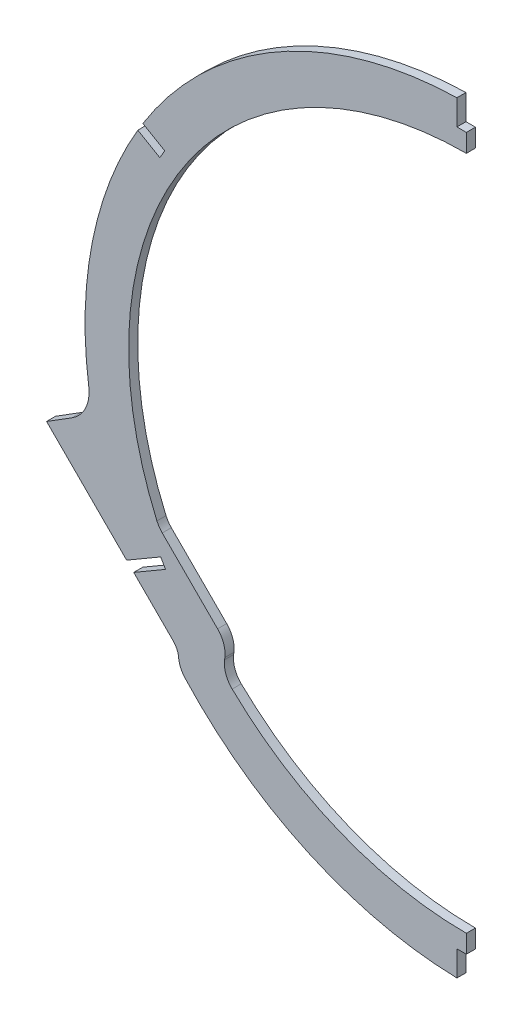
ISO-10303-21;
HEADER;
FILE_DESCRIPTION(('STEP AP214'),'2;1');
FILE_NAME('part.step','',(''),(''),'','','');
FILE_SCHEMA(('AUTOMOTIVE_DESIGN { 1 0 10303 214 1 1 1 1 }'));
ENDSEC;
DATA;
#1=APPLICATION_CONTEXT('core data for automotive mechanical design processes');
#2=APPLICATION_PROTOCOL_DEFINITION('international standard','automotive_design',2000,#1);
#3=PRODUCT_CONTEXT('',#1,'mechanical');
#4=PRODUCT('Part','Part','',(#3));
#5=PRODUCT_RELATED_PRODUCT_CATEGORY('part','',(#4));
#6=PRODUCT_DEFINITION_FORMATION('','',#4);
#7=PRODUCT_DEFINITION_CONTEXT('part definition',#1,'design');
#8=PRODUCT_DEFINITION('design','',#6,#7);
#9=PRODUCT_DEFINITION_SHAPE('','',#8);
#10=(LENGTH_UNIT() NAMED_UNIT(*) SI_UNIT(.MILLI.,.METRE.));
#11=(NAMED_UNIT(*) PLANE_ANGLE_UNIT() SI_UNIT($,.RADIAN.));
#12=(NAMED_UNIT(*) SI_UNIT($,.STERADIAN.) SOLID_ANGLE_UNIT());
#13=UNCERTAINTY_MEASURE_WITH_UNIT(LENGTH_MEASURE(1.E-05),#10,'distance_accuracy_value','');
#14=(GEOMETRIC_REPRESENTATION_CONTEXT(3) GLOBAL_UNCERTAINTY_ASSIGNED_CONTEXT((#13)) GLOBAL_UNIT_ASSIGNED_CONTEXT((#10,
#11,#12)) REPRESENTATION_CONTEXT('',''));
#15=CARTESIAN_POINT('',(0.,0.,0.));
#16=DIRECTION('',(0.,0.,1.));
#17=DIRECTION('',(1.,0.,0.));
#18=AXIS2_PLACEMENT_3D('',#15,#16,#17);
#19=CARTESIAN_POINT('',(0.,23.495,1.5875));
#20=DIRECTION('',(0.,0.,-1.));
#21=DIRECTION('',(-1.,0.,0.));
#22=AXIS2_PLACEMENT_3D('',#19,#20,#21);
#23=CYLINDRICAL_SURFACE('',#22,133.35);
#24=CARTESIAN_POINT('',(0.,23.495,1.5875));
#25=DIRECTION('',(0.,0.,1.));
#26=DIRECTION('',(1.,0.,0.));
#27=AXIS2_PLACEMENT_3D('',#24,#25,#26);
#28=CIRCLE('',#27,133.35);
#29=CARTESIAN_POINT('',(-3.302,156.804111826611,1.58750000000002));
#30=VERTEX_POINT('',#29);
#31=CARTESIAN_POINT('',(-113.138876948253,94.0769879493919,1.58750000000002));
#32=VERTEX_POINT('',#31);
#33=EDGE_CURVE('E360',#30,#32,#28,.T.);
#34=ORIENTED_EDGE('',*,*,#33,.F.);
#35=DIRECTION('',(0.,0.,-1.));
#36=VECTOR('',#35,1.);
#37=CARTESIAN_POINT('',(-3.302,156.804111826611,1.5875));
#38=LINE('',#37,#36);
#39=CARTESIAN_POINT('',(-3.302,156.804111826611,-1.5875));
#40=VERTEX_POINT('',#39);
#41=EDGE_CURVE('E241',#30,#40,#38,.T.);
#42=ORIENTED_EDGE('',*,*,#41,.T.);
#43=CARTESIAN_POINT('',(0.,23.495,-1.5875));
#44=DIRECTION('',(0.,0.,1.));
#45=DIRECTION('',(1.,0.,0.));
#46=AXIS2_PLACEMENT_3D('',#43,#44,#45);
#47=CIRCLE('',#46,133.35);
#48=CARTESIAN_POINT('',(-113.138876948253,94.0769879493919,-1.5875));
#49=VERTEX_POINT('',#48);
#50=EDGE_CURVE('E365',#40,#49,#47,.T.);
#51=ORIENTED_EDGE('',*,*,#50,.T.);
#52=DIRECTION('',(0.,0.,-1.));
#53=VECTOR('',#52,1.);
#54=CARTESIAN_POINT('',(-113.138876948253,94.0769879493919,1.5875));
#55=LINE('',#54,#53);
#56=EDGE_CURVE('E311',#49,#32,#55,.F.);
#57=ORIENTED_EDGE('',*,*,#56,.T.);
#58=EDGE_LOOP('',(#34,#42,#51,#57));
#59=FACE_BOUND('',#58,.T.);
#60=ADVANCED_FACE('F38',(#59),#23,.T.);
#61=CARTESIAN_POINT('',(-146.816619390262,-13.0034055734361,1.5875));
#62=DIRECTION('',(0.707231186017229,0.70698235446485,0.));
#63=DIRECTION('',(-0.70698235446485,0.707231186017229,0.));
#64=AXIS2_PLACEMENT_3D('',#61,#62,#63);
#65=PLANE('',#64);
#66=DIRECTION('',(0.70698235446485,-0.707231186017229,0.));
#67=VECTOR('',#66,1.);
#68=CARTESIAN_POINT('',(-146.816619390262,-13.0034055734361,1.5875));
#69=LINE('',#68,#67);
#70=CARTESIAN_POINT('',(-116.343103542525,-43.4876469678681,1.58750000000002));
#71=VERTEX_POINT('',#70);
#72=CARTESIAN_POINT('',(-102.50022805456,-57.3353946342901,1.5875));
#73=VERTEX_POINT('',#72);
#74=EDGE_CURVE('E320',#71,#73,#69,.T.);
#75=ORIENTED_EDGE('',*,*,#74,.F.);
#76=DIRECTION('',(0.,0.,-1.));
#77=VECTOR('',#76,1.);
#78=CARTESIAN_POINT('',(-116.343103542525,-43.4876469678681,1.5875));
#79=LINE('',#78,#77);
#80=CARTESIAN_POINT('',(-116.343103542525,-43.4876469678681,-1.5875));
#81=VERTEX_POINT('',#80);
#82=EDGE_CURVE('E46',#71,#81,#79,.T.);
#83=ORIENTED_EDGE('',*,*,#82,.T.);
#84=DIRECTION('',(0.70698235446485,-0.707231186017229,0.));
#85=VECTOR('',#84,1.);
#86=CARTESIAN_POINT('',(-146.816619390262,-13.0034055734361,-1.5875));
#87=LINE('',#86,#85);
#88=CARTESIAN_POINT('',(-102.50022805456,-57.3353946342901,-1.5875));
#89=VERTEX_POINT('',#88);
#90=EDGE_CURVE('E315',#81,#89,#87,.T.);
#91=ORIENTED_EDGE('',*,*,#90,.T.);
#92=DIRECTION('',(0.,0.,-1.));
#93=VECTOR('',#92,1.);
#94=CARTESIAN_POINT('',(-102.50022805456,-57.3353946342901,1.5875));
#95=LINE('',#94,#93);
#96=EDGE_CURVE('E410',#89,#73,#95,.F.);
#97=ORIENTED_EDGE('',*,*,#96,.T.);
#98=EDGE_LOOP('',(#75,#83,#91,#97));
#99=FACE_BOUND('',#98,.T.);
#100=ADVANCED_FACE('F435',(#99),#65,.F.);
#101=CARTESIAN_POINT('',(-114.89077453908,91.1879274430517,1.58750000000002));
#102=VERTEX_POINT('',#101);
#103=CARTESIAN_POINT('',(-132.072296559538,5.07949073499789,1.5875));
#104=VERTEX_POINT('',#103);
#105=EDGE_CURVE('E361',#102,#104,#28,.T.);
#106=ORIENTED_EDGE('',*,*,#105,.F.);
#107=DIRECTION('',(0.,0.,-1.));
#108=VECTOR('',#107,1.);
#109=CARTESIAN_POINT('',(-114.89077453908,91.1879274430517,1.5875));
#110=LINE('',#109,#108);
#111=CARTESIAN_POINT('',(-114.89077453908,91.1879274430517,-1.5875));
#112=VERTEX_POINT('',#111);
#113=EDGE_CURVE('E308',#102,#112,#110,.T.);
#114=ORIENTED_EDGE('',*,*,#113,.T.);
#115=CARTESIAN_POINT('',(-132.072296559538,5.07949073499789,-1.5875));
#116=VERTEX_POINT('',#115);
#117=EDGE_CURVE('E355',#112,#116,#47,.T.);
#118=ORIENTED_EDGE('',*,*,#117,.T.);
#119=DIRECTION('',(0.,0.,-1.));
#120=VECTOR('',#119,1.);
#121=CARTESIAN_POINT('',(-132.072296559538,5.07949073499789,1.5875));
#122=LINE('',#121,#120);
#123=EDGE_CURVE('E421',#116,#104,#122,.F.);
#124=ORIENTED_EDGE('',*,*,#123,.T.);
#125=EDGE_LOOP('',(#106,#114,#118,#124));
#126=FACE_BOUND('',#125,.T.);
#127=ADVANCED_FACE('F509',(#126),#23,.T.);
#128=CARTESIAN_POINT('',(-98.3628153936642,-66.5437641398522,-1.5875));
#129=VERTEX_POINT('',#128);
#130=CARTESIAN_POINT('',(-3.302,-109.814111826611,-1.5875));
#131=VERTEX_POINT('',#130);
#132=EDGE_CURVE('E362',#129,#131,#47,.T.);
#133=ORIENTED_EDGE('',*,*,#132,.T.);
#134=DIRECTION('',(0.,0.,-1.));
#135=VECTOR('',#134,1.);
#136=CARTESIAN_POINT('',(-3.302,-109.814111826611,1.5875));
#137=LINE('',#136,#135);
#138=CARTESIAN_POINT('',(-3.302,-109.814111826611,1.58750000000002));
#139=VERTEX_POINT('',#138);
#140=EDGE_CURVE('E234',#131,#139,#137,.F.);
#141=ORIENTED_EDGE('',*,*,#140,.T.);
#142=CARTESIAN_POINT('',(-98.3628153936642,-66.5437641398522,1.5875));
#143=VERTEX_POINT('',#142);
#144=EDGE_CURVE('E356',#143,#139,#28,.T.);
#145=ORIENTED_EDGE('',*,*,#144,.F.);
#146=DIRECTION('',(0.,0.,-1.));
#147=VECTOR('',#146,1.);
#148=CARTESIAN_POINT('',(-98.3628153936642,-66.5437641398522,1.5875));
#149=LINE('',#148,#147);
#150=EDGE_CURVE('E380',#143,#129,#149,.T.);
#151=ORIENTED_EDGE('',*,*,#150,.T.);
#152=EDGE_LOOP('',(#133,#141,#145,#151));
#153=FACE_BOUND('',#152,.T.);
#154=ADVANCED_FACE('F455',(#153),#23,.T.);
#155=CARTESIAN_POINT('',(0.,23.495,1.5875));
#156=DIRECTION('',(0.,0.,1.));
#157=DIRECTION('',(1.,0.,0.));
#158=AXIS2_PLACEMENT_3D('',#155,#156,#157);
#159=PLANE('',#158);
#160=DIRECTION('',(0.,1.,0.));
#161=VECTOR('',#160,1.);
#162=CARTESIAN_POINT('',(-3.302,147.955,1.58750000000002));
#163=LINE('',#162,#161);
#164=CARTESIAN_POINT('',(-3.302,147.955,1.58750000000002));
#165=VERTEX_POINT('',#164);
#166=EDGE_CURVE('E238',#165,#30,#163,.T.);
#167=ORIENTED_EDGE('',*,*,#166,.T.);
#168=ORIENTED_EDGE('',*,*,#33,.T.);
#169=DIRECTION('',(0.864121648134545,-0.503282999141872,0.));
#170=VECTOR('',#169,1.);
#171=CARTESIAN_POINT('',(-105.489605781952,89.6218882048872,1.58750000000002));
#172=LINE('',#171,#170);
#173=CARTESIAN_POINT('',(-105.489605781952,89.6218882048872,1.58750000000002));
#174=VERTEX_POINT('',#173);
#175=EDGE_CURVE('E264',#32,#174,#172,.T.);
#176=ORIENTED_EDGE('',*,*,#175,.T.);
#177=DIRECTION('',(-0.503282999141872,-0.864121648134545,0.));
#178=VECTOR('',#177,1.);
#179=CARTESIAN_POINT('',(-105.489605781952,89.6218882048872,1.58750000000002));
#180=LINE('',#179,#178);
#181=CARTESIAN_POINT('',(-107.189796409653,86.7027124531591,1.58750000000002));
#182=VERTEX_POINT('',#181);
#183=EDGE_CURVE('E268',#174,#182,#180,.T.);
#184=ORIENTED_EDGE('',*,*,#183,.T.);
#185=DIRECTION('',(-0.864121648134546,0.503282999141871,0.));
#186=VECTOR('',#185,1.);
#187=CARTESIAN_POINT('',(-107.189796409653,86.7027124531591,1.58750000000002));
#188=LINE('',#187,#186);
#189=EDGE_CURVE('E258',#182,#102,#188,.T.);
#190=ORIENTED_EDGE('',*,*,#189,.T.);
#191=ORIENTED_EDGE('',*,*,#105,.T.);
#192=CARTESIAN_POINT('',(-144.650610517589,3.32563270975959,1.5875));
#193=DIRECTION('',(0.,0.,1.));
#194=DIRECTION('',(1.,0.,0.));
#195=AXIS2_PLACEMENT_3D('',#192,#193,#194);
#196=CIRCLE('',#195,12.7);
#197=CARTESIAN_POINT('',(-137.920635861828,-7.44457811142701,1.5875));
#198=VERTEX_POINT('',#197);
#199=EDGE_CURVE('E427',#104,#198,#196,.F.);
#200=ORIENTED_EDGE('',*,*,#199,.T.);
#201=DIRECTION('',(-0.848048096156425,-0.529919264233206,0.));
#202=VECTOR('',#201,1.);
#203=CARTESIAN_POINT('',(-146.816619390262,-13.0034055734361,1.5875));
#204=LINE('',#203,#202);
#205=CARTESIAN_POINT('',(-146.816619390262,-13.0034055734361,1.5875));
#206=VERTEX_POINT('',#205);
#207=EDGE_CURVE('E319',#198,#206,#204,.T.);
#208=ORIENTED_EDGE('',*,*,#207,.T.);
#209=CARTESIAN_POINT('',(-118.813073785274,-41.0168073872547,1.5875));
#210=VERTEX_POINT('',#209);
#211=EDGE_CURVE('E316',#206,#210,#69,.T.);
#212=ORIENTED_EDGE('',*,*,#211,.T.);
#213=DIRECTION('',(0.86412164939881,0.503282996971168,0.));
#214=VECTOR('',#213,1.);
#215=CARTESIAN_POINT('',(-106.901857929637,-34.0794595988201,1.58750000000002));
#216=LINE('',#215,#214);
#217=CARTESIAN_POINT('',(-106.901857929637,-34.0794595988201,1.58750000000002));
#218=VERTEX_POINT('',#217);
#219=EDGE_CURVE('E289',#210,#218,#216,.T.);
#220=ORIENTED_EDGE('',*,*,#219,.T.);
#221=DIRECTION('',(0.503282996971169,-0.864121649398809,0.));
#222=VECTOR('',#221,1.);
#223=CARTESIAN_POINT('',(-105.201667309269,-36.9986353548192,1.58750000000002));
#224=LINE('',#223,#222);
#225=CARTESIAN_POINT('',(-105.201667309269,-36.9986353548192,1.58750000000002));
#226=VERTEX_POINT('',#225);
#227=EDGE_CURVE('E276',#218,#226,#224,.T.);
#228=ORIENTED_EDGE('',*,*,#227,.T.);
#229=DIRECTION('',(-0.86412164939881,-0.503282996971167,0.));
#230=VECTOR('',#229,1.);
#231=CARTESIAN_POINT('',(-105.201667309269,-36.9986353548192,1.58750000000002));
#232=LINE('',#231,#230);
#233=EDGE_CURVE('E284',#226,#71,#232,.T.);
#234=ORIENTED_EDGE('',*,*,#233,.T.);
#235=ORIENTED_EDGE('',*,*,#74,.T.);
#236=CARTESIAN_POINT('',(-106.991146085769,-61.8247325851419,1.5875));
#237=DIRECTION('',(0.,0.,1.));
#238=DIRECTION('',(1.,0.,0.));
#239=AXIS2_PLACEMENT_3D('',#236,#237,#238);
#240=CIRCLE('',#239,6.35);
#241=CARTESIAN_POINT('',(-100.66370786979,-61.2899189512753,1.5875));
#242=VERTEX_POINT('',#241);
#243=EDGE_CURVE('E416',#73,#242,#240,.F.);
#244=ORIENTED_EDGE('',*,*,#243,.T.);
#245=CARTESIAN_POINT('',(-91.8052943674199,-60.541179863862,1.5875));
#246=DIRECTION('',(0.,0.,1.));
#247=DIRECTION('',(1.,0.,0.));
#248=AXIS2_PLACEMENT_3D('',#245,#246,#247);
#249=CIRCLE('',#248,8.89);
#250=EDGE_CURVE('E385',#242,#143,#249,.T.);
#251=ORIENTED_EDGE('',*,*,#250,.T.);
#252=ORIENTED_EDGE('',*,*,#144,.T.);
#253=DIRECTION('',(0.,1.,0.));
#254=VECTOR('',#253,1.);
#255=CARTESIAN_POINT('',(-3.302,-100.965,1.58750000000002));
#256=LINE('',#255,#254);
#257=CARTESIAN_POINT('',(-3.302,-100.965,1.58750000000002));
#258=VERTEX_POINT('',#257);
#259=EDGE_CURVE('E300',#139,#258,#256,.T.);
#260=ORIENTED_EDGE('',*,*,#259,.T.);
#261=DIRECTION('',(1.,0.,0.));
#262=VECTOR('',#261,1.);
#263=CARTESIAN_POINT('',(0.,-100.965,1.58750000000002));
#264=LINE('',#263,#262);
#265=CARTESIAN_POINT('',(0.,-100.965,1.58750000000002));
#266=VERTEX_POINT('',#265);
#267=EDGE_CURVE('E296',#258,#266,#264,.T.);
#268=ORIENTED_EDGE('',*,*,#267,.T.);
#269=DIRECTION('',(0.,1.,0.));
#270=VECTOR('',#269,1.);
#271=CARTESIAN_POINT('',(0.,23.495,1.5875));
#272=LINE('',#271,#270);
#273=CARTESIAN_POINT('',(0.,-94.615,1.58750000000002));
#274=VERTEX_POINT('',#273);
#275=EDGE_CURVE('E332',#266,#274,#272,.T.);
#276=ORIENTED_EDGE('',*,*,#275,.T.);
#277=CARTESIAN_POINT('',(0.,23.495,1.5875));
#278=DIRECTION('',(0.,0.,1.));
#279=DIRECTION('',(1.,0.,0.));
#280=AXIS2_PLACEMENT_3D('',#277,#278,#279);
#281=CIRCLE('',#280,118.11);
#282=CARTESIAN_POINT('',(-81.9078237601201,-61.5995386430944,1.5875));
#283=VERTEX_POINT('',#282);
#284=EDGE_CURVE('E350',#283,#274,#281,.T.);
#285=ORIENTED_EDGE('',*,*,#284,.F.);
#286=CARTESIAN_POINT('',(-75.7427187459176,-55.194573368883,1.58750000000002));
#287=DIRECTION('',(0.,0.,1.));
#288=DIRECTION('',(1.,0.,0.));
#289=AXIS2_PLACEMENT_3D('',#286,#287,#288);
#290=CIRCLE('',#289,8.89);
#291=CARTESIAN_POINT('',(-84.5586484006429,-54.049372808748,1.5875));
#292=VERTEX_POINT('',#291);
#293=EDGE_CURVE('E397',#283,#292,#290,.F.);
#294=ORIENTED_EDGE('',*,*,#293,.T.);
#295=DIRECTION('',(-0.128818960645114,-0.99166812764065,0.));
#296=VECTOR('',#295,1.);
#297=CARTESIAN_POINT('',(-83.9033103862479,-49.0044802055757,1.5875));
#298=LINE('',#297,#296);
#299=CARTESIAN_POINT('',(-84.4668356789766,-53.3425843877536,1.5875));
#300=VERTEX_POINT('',#299);
#301=EDGE_CURVE('E346',#300,#292,#298,.T.);
#302=ORIENTED_EDGE('',*,*,#301,.F.);
#303=CARTESIAN_POINT('',(-93.2827653337019,-52.1973838276185,1.58750000000002));
#304=DIRECTION('',(0.,0.,1.));
#305=DIRECTION('',(1.,0.,0.));
#306=AXIS2_PLACEMENT_3D('',#303,#304,#305);
#307=CIRCLE('',#306,8.89);
#308=CARTESIAN_POINT('',(-86.9965860489536,-45.9112045428701,1.5875));
#309=VERTEX_POINT('',#308);
#310=EDGE_CURVE('E383',#300,#309,#307,.T.);
#311=ORIENTED_EDGE('',*,*,#310,.T.);
#312=DIRECTION('',(0.707106781186551,-0.707106781186544,0.));
#313=VECTOR('',#312,1.);
#314=CARTESIAN_POINT('',(-107.519100249958,-25.3886903418656,1.5875));
#315=LINE('',#314,#313);
#316=CARTESIAN_POINT('',(-106.356428701463,-26.5513618903612,1.5875));
#317=VERTEX_POINT('',#316);
#318=EDGE_CURVE('E343',#317,#309,#315,.T.);
#319=ORIENTED_EDGE('',*,*,#318,.F.);
#320=CARTESIAN_POINT('',(-100.070249416714,-20.2651826056128,1.58750000000002));
#321=DIRECTION('',(0.,0.,1.));
#322=DIRECTION('',(1.,0.,0.));
#323=AXIS2_PLACEMENT_3D('',#320,#321,#322);
#324=CIRCLE('',#323,8.89);
#325=CARTESIAN_POINT('',(-108.215502276214,-23.8270579339766,1.5875));
#326=VERTEX_POINT('',#325);
#327=EDGE_CURVE('E392',#317,#326,#324,.F.);
#328=ORIENTED_EDGE('',*,*,#327,.T.);
#329=CARTESIAN_POINT('',(0.,141.605,1.5875));
#330=VERTEX_POINT('',#329);
#331=EDGE_CURVE('E349',#330,#326,#281,.T.);
#332=ORIENTED_EDGE('',*,*,#331,.F.);
#333=CARTESIAN_POINT('',(0.,147.955,1.5875));
#334=VERTEX_POINT('',#333);
#335=EDGE_CURVE('E249',#330,#334,#272,.T.);
#336=ORIENTED_EDGE('',*,*,#335,.T.);
#337=DIRECTION('',(-1.,0.,0.));
#338=VECTOR('',#337,1.);
#339=CARTESIAN_POINT('',(0.,147.955,1.58750000000002));
#340=LINE('',#339,#338);
#341=EDGE_CURVE('E228',#334,#165,#340,.T.);
#342=ORIENTED_EDGE('',*,*,#341,.T.);
#343=EDGE_LOOP('',(#167,#168,#176,#184,#190,#191,#200,#208,#212,#220,#228,#234,#235,#244,#251,
#252,#260,#268,#276,#285,#294,#302,#311,#319,#328,#332,#336,#342));
#344=FACE_BOUND('',#343,.T.);
#345=ADVANCED_FACE('F247',(#344),#159,.T.);
#346=CARTESIAN_POINT('',(0.,23.495,-1.5875));
#347=DIRECTION('',(0.,0.,1.));
#348=DIRECTION('',(1.,0.,0.));
#349=AXIS2_PLACEMENT_3D('',#346,#347,#348);
#350=PLANE('',#349);
#351=ORIENTED_EDGE('',*,*,#50,.F.);
#352=DIRECTION('',(0.,1.,0.));
#353=VECTOR('',#352,1.);
#354=CARTESIAN_POINT('',(-3.302,147.955,-1.5875));
#355=LINE('',#354,#353);
#356=CARTESIAN_POINT('',(-3.302,147.955,-1.5875));
#357=VERTEX_POINT('',#356);
#358=EDGE_CURVE('E250',#357,#40,#355,.T.);
#359=ORIENTED_EDGE('',*,*,#358,.F.);
#360=DIRECTION('',(-1.,0.,0.));
#361=VECTOR('',#360,1.);
#362=CARTESIAN_POINT('',(0.,147.955,-1.5875));
#363=LINE('',#362,#361);
#364=CARTESIAN_POINT('',(0.,147.955,-1.5875));
#365=VERTEX_POINT('',#364);
#366=EDGE_CURVE('E231',#365,#357,#363,.T.);
#367=ORIENTED_EDGE('',*,*,#366,.F.);
#368=DIRECTION('',(0.,1.,0.));
#369=VECTOR('',#368,1.);
#370=CARTESIAN_POINT('',(0.,23.495,-1.5875));
#371=LINE('',#370,#369);
#372=CARTESIAN_POINT('',(0.,141.605,-1.58750000000002));
#373=VERTEX_POINT('',#372);
#374=EDGE_CURVE('E333',#373,#365,#371,.T.);
#375=ORIENTED_EDGE('',*,*,#374,.F.);
#376=CARTESIAN_POINT('',(0.,23.495,-1.58750000000002));
#377=DIRECTION('',(0.,0.,1.));
#378=DIRECTION('',(1.,0.,0.));
#379=AXIS2_PLACEMENT_3D('',#376,#377,#378);
#380=CIRCLE('',#379,118.11);
#381=CARTESIAN_POINT('',(-108.215502276214,-23.8270579339766,-1.58750000000002));
#382=VERTEX_POINT('',#381);
#383=EDGE_CURVE('E335',#382,#373,#380,.F.);
#384=ORIENTED_EDGE('',*,*,#383,.F.);
#385=CARTESIAN_POINT('',(-100.070249416714,-20.2651826056128,-1.58750000000002));
#386=DIRECTION('',(0.,0.,1.));
#387=DIRECTION('',(1.,0.,0.));
#388=AXIS2_PLACEMENT_3D('',#385,#386,#387);
#389=CIRCLE('',#388,8.89);
#390=CARTESIAN_POINT('',(-106.356428701463,-26.5513618903612,-1.58750000000002));
#391=VERTEX_POINT('',#390);
#392=EDGE_CURVE('E395',#382,#391,#389,.T.);
#393=ORIENTED_EDGE('',*,*,#392,.T.);
#394=DIRECTION('',(-0.707106781186552,0.707106781186544,0.));
#395=VECTOR('',#394,1.);
#396=CARTESIAN_POINT('',(-107.519100249958,-25.3886903418656,-1.58750000000002));
#397=LINE('',#396,#395);
#398=CARTESIAN_POINT('',(-86.9965860489536,-45.9112045428701,-1.58750000000002));
#399=VERTEX_POINT('',#398);
#400=EDGE_CURVE('E338',#399,#391,#397,.T.);
#401=ORIENTED_EDGE('',*,*,#400,.F.);
#402=CARTESIAN_POINT('',(-93.2827653337019,-52.1973838276185,-1.58750000000002));
#403=DIRECTION('',(0.,0.,1.));
#404=DIRECTION('',(1.,0.,0.));
#405=AXIS2_PLACEMENT_3D('',#402,#403,#404);
#406=CIRCLE('',#405,8.89);
#407=CARTESIAN_POINT('',(-84.4668356789766,-53.3425843877536,-1.58750000000002));
#408=VERTEX_POINT('',#407);
#409=EDGE_CURVE('E375',#399,#408,#406,.F.);
#410=ORIENTED_EDGE('',*,*,#409,.T.);
#411=DIRECTION('',(0.128818960645114,0.99166812764065,0.));
#412=VECTOR('',#411,1.);
#413=CARTESIAN_POINT('',(-83.9033103862479,-49.0044802055757,-1.58750000000002));
#414=LINE('',#413,#412);
#415=CARTESIAN_POINT('',(-84.5586484006429,-54.049372808748,-1.58750000000002));
#416=VERTEX_POINT('',#415);
#417=EDGE_CURVE('E342',#416,#408,#414,.T.);
#418=ORIENTED_EDGE('',*,*,#417,.F.);
#419=CARTESIAN_POINT('',(-75.7427187459176,-55.194573368883,-1.58750000000002));
#420=DIRECTION('',(0.,0.,1.));
#421=DIRECTION('',(1.,0.,0.));
#422=AXIS2_PLACEMENT_3D('',#419,#420,#421);
#423=CIRCLE('',#422,8.89);
#424=CARTESIAN_POINT('',(-81.9078237601201,-61.5995386430944,-1.58750000000002));
#425=VERTEX_POINT('',#424);
#426=EDGE_CURVE('E399',#416,#425,#423,.T.);
#427=ORIENTED_EDGE('',*,*,#426,.T.);
#428=CARTESIAN_POINT('',(0.,-94.615,-1.58750000000002));
#429=VERTEX_POINT('',#428);
#430=EDGE_CURVE('E339',#429,#425,#380,.F.);
#431=ORIENTED_EDGE('',*,*,#430,.F.);
#432=CARTESIAN_POINT('',(0.,-100.965,-1.5875));
#433=VERTEX_POINT('',#432);
#434=EDGE_CURVE('E330',#433,#429,#371,.T.);
#435=ORIENTED_EDGE('',*,*,#434,.F.);
#436=DIRECTION('',(1.,0.,0.));
#437=VECTOR('',#436,1.);
#438=CARTESIAN_POINT('',(0.,-100.965,-1.5875));
#439=LINE('',#438,#437);
#440=CARTESIAN_POINT('',(-3.302,-100.965,-1.5875));
#441=VERTEX_POINT('',#440);
#442=EDGE_CURVE('E61',#441,#433,#439,.T.);
#443=ORIENTED_EDGE('',*,*,#442,.F.);
#444=DIRECTION('',(0.,1.,0.));
#445=VECTOR('',#444,1.);
#446=CARTESIAN_POINT('',(-3.302,-100.965,-1.5875));
#447=LINE('',#446,#445);
#448=EDGE_CURVE('E279',#131,#441,#447,.T.);
#449=ORIENTED_EDGE('',*,*,#448,.F.);
#450=ORIENTED_EDGE('',*,*,#132,.F.);
#451=CARTESIAN_POINT('',(-91.8052943674199,-60.541179863862,-1.5875));
#452=DIRECTION('',(0.,0.,1.));
#453=DIRECTION('',(1.,0.,0.));
#454=AXIS2_PLACEMENT_3D('',#451,#452,#453);
#455=CIRCLE('',#454,8.89);
#456=CARTESIAN_POINT('',(-100.66370786979,-61.2899189512753,-1.5875));
#457=VERTEX_POINT('',#456);
#458=EDGE_CURVE('E377',#129,#457,#455,.F.);
#459=ORIENTED_EDGE('',*,*,#458,.T.);
#460=CARTESIAN_POINT('',(-106.991146085769,-61.8247325851419,-1.5875));
#461=DIRECTION('',(0.,0.,1.));
#462=DIRECTION('',(1.,0.,0.));
#463=AXIS2_PLACEMENT_3D('',#460,#461,#462);
#464=CIRCLE('',#463,6.35);
#465=EDGE_CURVE('E413',#457,#89,#464,.T.);
#466=ORIENTED_EDGE('',*,*,#465,.T.);
#467=ORIENTED_EDGE('',*,*,#90,.F.);
#468=DIRECTION('',(-0.86412164939881,-0.503282996971167,0.));
#469=VECTOR('',#468,1.);
#470=CARTESIAN_POINT('',(-105.201667309269,-36.9986353548192,-1.5875));
#471=LINE('',#470,#469);
#472=CARTESIAN_POINT('',(-105.201667309269,-36.9986353548192,-1.5875));
#473=VERTEX_POINT('',#472);
#474=EDGE_CURVE('E261',#473,#81,#471,.T.);
#475=ORIENTED_EDGE('',*,*,#474,.F.);
#476=DIRECTION('',(0.503282996971169,-0.864121649398809,0.));
#477=VECTOR('',#476,1.);
#478=CARTESIAN_POINT('',(-105.201667309269,-36.9986353548192,-1.5875));
#479=LINE('',#478,#477);
#480=CARTESIAN_POINT('',(-106.901857929637,-34.0794595988201,-1.5875));
#481=VERTEX_POINT('',#480);
#482=EDGE_CURVE('E280',#481,#473,#479,.T.);
#483=ORIENTED_EDGE('',*,*,#482,.F.);
#484=DIRECTION('',(0.86412164939881,0.503282996971168,0.));
#485=VECTOR('',#484,1.);
#486=CARTESIAN_POINT('',(-106.901857929637,-34.0794595988201,-1.5875));
#487=LINE('',#486,#485);
#488=CARTESIAN_POINT('',(-118.813073785274,-41.0168073872548,-1.5875));
#489=VERTEX_POINT('',#488);
#490=EDGE_CURVE('E283',#489,#481,#487,.T.);
#491=ORIENTED_EDGE('',*,*,#490,.F.);
#492=CARTESIAN_POINT('',(-146.816619390262,-13.0034055734361,-1.5875));
#493=VERTEX_POINT('',#492);
#494=EDGE_CURVE('E323',#493,#489,#87,.T.);
#495=ORIENTED_EDGE('',*,*,#494,.F.);
#496=DIRECTION('',(-0.848048096156425,-0.529919264233206,0.));
#497=VECTOR('',#496,1.);
#498=CARTESIAN_POINT('',(-146.816619390262,-13.0034055734361,-1.5875));
#499=LINE('',#498,#497);
#500=CARTESIAN_POINT('',(-137.920635861828,-7.44457811142701,-1.5875));
#501=VERTEX_POINT('',#500);
#502=EDGE_CURVE('E326',#501,#493,#499,.T.);
#503=ORIENTED_EDGE('',*,*,#502,.F.);
#504=CARTESIAN_POINT('',(-144.650610517589,3.32563270975959,-1.5875));
#505=DIRECTION('',(0.,0.,1.));
#506=DIRECTION('',(1.,0.,0.));
#507=AXIS2_PLACEMENT_3D('',#504,#505,#506);
#508=CIRCLE('',#507,12.7);
#509=EDGE_CURVE('E424',#501,#116,#508,.T.);
#510=ORIENTED_EDGE('',*,*,#509,.T.);
#511=ORIENTED_EDGE('',*,*,#117,.F.);
#512=DIRECTION('',(-0.864121648134546,0.503282999141871,0.));
#513=VECTOR('',#512,1.);
#514=CARTESIAN_POINT('',(-107.189796409653,86.7027124531591,-1.5875));
#515=LINE('',#514,#513);
#516=CARTESIAN_POINT('',(-107.189796409653,86.7027124531591,-1.5875));
#517=VERTEX_POINT('',#516);
#518=EDGE_CURVE('E262',#517,#112,#515,.T.);
#519=ORIENTED_EDGE('',*,*,#518,.F.);
#520=DIRECTION('',(-0.503282999141872,-0.864121648134545,0.));
#521=VECTOR('',#520,1.);
#522=CARTESIAN_POINT('',(-105.489605781952,89.6218882048872,-1.5875));
#523=LINE('',#522,#521);
#524=CARTESIAN_POINT('',(-105.489605781952,89.6218882048872,-1.5875));
#525=VERTEX_POINT('',#524);
#526=EDGE_CURVE('E254',#525,#517,#523,.T.);
#527=ORIENTED_EDGE('',*,*,#526,.F.);
#528=DIRECTION('',(-0.864121648134545,0.503282999141872,0.));
#529=VECTOR('',#528,1.);
#530=CARTESIAN_POINT('',(2.03857317632691,26.9951683267149,-1.5875));
#531=LINE('',#530,#529);
#532=EDGE_CURVE('E11',#525,#49,#531,.T.);
#533=ORIENTED_EDGE('',*,*,#532,.T.);
#534=EDGE_LOOP('',(#351,#359,#367,#375,#384,#393,#401,#410,#418,#427,#431,#435,#443,#449,#450,
#459,#466,#467,#475,#483,#491,#495,#503,#510,#511,#519,#527,#533));
#535=FACE_BOUND('',#534,.T.);
#536=ADVANCED_FACE('F441',(#535),#350,.F.);
#537=CARTESIAN_POINT('',(0.,23.495,-335.653027703772));
#538=DIRECTION('',(0.,0.,1.));
#539=DIRECTION('',(1.,0.,0.));
#540=AXIS2_PLACEMENT_3D('',#537,#538,#539);
#541=CYLINDRICAL_SURFACE('',#540,118.11);
#542=DIRECTION('',(0.,0.,1.));
#543=VECTOR('',#542,1.);
#544=CARTESIAN_POINT('',(0.,141.605,-335.653027703772));
#545=LINE('',#544,#543);
#546=EDGE_CURVE('E405',#330,#373,#545,.F.);
#547=ORIENTED_EDGE('',*,*,#546,.F.);
#548=ORIENTED_EDGE('',*,*,#331,.T.);
#549=DIRECTION('',(0.,0.,1.));
#550=VECTOR('',#549,1.);
#551=CARTESIAN_POINT('',(-108.215502276214,-23.8270579339766,-335.653027703772));
#552=LINE('',#551,#550);
#553=EDGE_CURVE('E373',#326,#382,#552,.F.);
#554=ORIENTED_EDGE('',*,*,#553,.T.);
#555=ORIENTED_EDGE('',*,*,#383,.T.);
#556=EDGE_LOOP('',(#547,#548,#554,#555));
#557=FACE_BOUND('',#556,.T.);
#558=ADVANCED_FACE('F495',(#557),#541,.F.);
#559=DIRECTION('',(0.,0.,1.));
#560=VECTOR('',#559,1.);
#561=CARTESIAN_POINT('',(0.,-94.615,-335.653027703772));
#562=LINE('',#561,#560);
#563=EDGE_CURVE('E402',#429,#274,#562,.T.);
#564=ORIENTED_EDGE('',*,*,#563,.F.);
#565=ORIENTED_EDGE('',*,*,#430,.T.);
#566=DIRECTION('',(0.,0.,1.));
#567=VECTOR('',#566,1.);
#568=CARTESIAN_POINT('',(-81.9078237601201,-61.5995386430944,-335.653027703772));
#569=LINE('',#568,#567);
#570=EDGE_CURVE('E370',#425,#283,#569,.T.);
#571=ORIENTED_EDGE('',*,*,#570,.T.);
#572=ORIENTED_EDGE('',*,*,#284,.T.);
#573=EDGE_LOOP('',(#564,#565,#571,#572));
#574=FACE_BOUND('',#573,.T.);
#575=ADVANCED_FACE('F469',(#574),#541,.F.);
#576=CARTESIAN_POINT('',(-107.519100249958,-25.3886903418656,-335.653027703772));
#577=DIRECTION('',(-0.707106781186544,-0.707106781186552,0.));
#578=DIRECTION('',(0.707106781186552,-0.707106781186544,0.));
#579=AXIS2_PLACEMENT_3D('',#576,#577,#578);
#580=PLANE('',#579);
#581=ORIENTED_EDGE('',*,*,#400,.T.);
#582=DIRECTION('',(0.,0.,-1.));
#583=VECTOR('',#582,1.);
#584=CARTESIAN_POINT('',(-106.356428701463,-26.5513618903612,1.58750000000002));
#585=LINE('',#584,#583);
#586=EDGE_CURVE('E367',#391,#317,#585,.F.);
#587=ORIENTED_EDGE('',*,*,#586,.T.);
#588=ORIENTED_EDGE('',*,*,#318,.T.);
#589=DIRECTION('',(0.,0.,1.));
#590=VECTOR('',#589,1.);
#591=CARTESIAN_POINT('',(-86.9965860489536,-45.9112045428701,-335.653027703772));
#592=LINE('',#591,#590);
#593=EDGE_CURVE('E359',#309,#399,#592,.F.);
#594=ORIENTED_EDGE('',*,*,#593,.T.);
#595=EDGE_LOOP('',(#581,#587,#588,#594));
#596=FACE_BOUND('',#595,.T.);
#597=ADVANCED_FACE('F487',(#596),#580,.F.);
#598=CARTESIAN_POINT('',(-83.9033103862479,-49.0044802055757,-335.653027703772));
#599=DIRECTION('',(-0.99166812764065,0.128818960645114,0.));
#600=DIRECTION('',(-0.128818960645114,-0.99166812764065,0.));
#601=AXIS2_PLACEMENT_3D('',#598,#599,#600);
#602=PLANE('',#601);
#603=ORIENTED_EDGE('',*,*,#417,.T.);
#604=DIRECTION('',(0.,0.,1.));
#605=VECTOR('',#604,1.);
#606=CARTESIAN_POINT('',(-84.4668356789766,-53.3425843877536,-335.653027703772));
#607=LINE('',#606,#605);
#608=EDGE_CURVE('E389',#408,#300,#607,.T.);
#609=ORIENTED_EDGE('',*,*,#608,.T.);
#610=ORIENTED_EDGE('',*,*,#301,.T.);
#611=DIRECTION('',(0.,0.,-1.));
#612=VECTOR('',#611,1.);
#613=CARTESIAN_POINT('',(-84.5586484006429,-54.049372808748,-1.58750000000002));
#614=LINE('',#613,#612);
#615=EDGE_CURVE('E387',#292,#416,#614,.T.);
#616=ORIENTED_EDGE('',*,*,#615,.T.);
#617=EDGE_LOOP('',(#603,#609,#610,#616));
#618=FACE_BOUND('',#617,.T.);
#619=ADVANCED_FACE('F475',(#618),#602,.F.);
#620=CARTESIAN_POINT('',(-100.070249416714,-20.2651826056128,-335.653027703772));
#621=DIRECTION('',(0.,0.,1.));
#622=DIRECTION('',(1.,0.,0.));
#623=AXIS2_PLACEMENT_3D('',#620,#621,#622);
#624=CYLINDRICAL_SURFACE('',#623,8.89);
#625=ORIENTED_EDGE('',*,*,#392,.F.);
#626=ORIENTED_EDGE('',*,*,#553,.F.);
#627=ORIENTED_EDGE('',*,*,#327,.F.);
#628=ORIENTED_EDGE('',*,*,#586,.F.);
#629=EDGE_LOOP('',(#625,#626,#627,#628));
#630=FACE_BOUND('',#629,.T.);
#631=ADVANCED_FACE('F491',(#630),#624,.F.);
#632=CARTESIAN_POINT('',(-91.8052943674199,-60.541179863862,1.5875));
#633=DIRECTION('',(0.,0.,-1.));
#634=DIRECTION('',(-1.,0.,0.));
#635=AXIS2_PLACEMENT_3D('',#632,#633,#634);
#636=CYLINDRICAL_SURFACE('',#635,8.89);
#637=ORIENTED_EDGE('',*,*,#250,.F.);
#638=DIRECTION('',(0.,0.,-1.));
#639=VECTOR('',#638,1.);
#640=CARTESIAN_POINT('',(-100.66370786979,-61.2899189512753,1.5875));
#641=LINE('',#640,#639);
#642=EDGE_CURVE('E407',#242,#457,#641,.T.);
#643=ORIENTED_EDGE('',*,*,#642,.T.);
#644=ORIENTED_EDGE('',*,*,#458,.F.);
#645=ORIENTED_EDGE('',*,*,#150,.F.);
#646=EDGE_LOOP('',(#637,#643,#644,#645));
#647=FACE_BOUND('',#646,.T.);
#648=ADVANCED_FACE('F453',(#647),#636,.T.);
#649=CARTESIAN_POINT('',(-93.2827653337019,-52.1973838276185,-335.653027703772));
#650=DIRECTION('',(0.,0.,1.));
#651=DIRECTION('',(1.,0.,0.));
#652=AXIS2_PLACEMENT_3D('',#649,#650,#651);
#653=CYLINDRICAL_SURFACE('',#652,8.89);
#654=ORIENTED_EDGE('',*,*,#409,.F.);
#655=ORIENTED_EDGE('',*,*,#593,.F.);
#656=ORIENTED_EDGE('',*,*,#310,.F.);
#657=ORIENTED_EDGE('',*,*,#608,.F.);
#658=EDGE_LOOP('',(#654,#655,#656,#657));
#659=FACE_BOUND('',#658,.T.);
#660=ADVANCED_FACE('F483',(#659),#653,.T.);
#661=CARTESIAN_POINT('',(-75.7427187459176,-55.194573368883,-335.653027703772));
#662=DIRECTION('',(0.,0.,1.));
#663=DIRECTION('',(1.,0.,0.));
#664=AXIS2_PLACEMENT_3D('',#661,#662,#663);
#665=CYLINDRICAL_SURFACE('',#664,8.89);
#666=ORIENTED_EDGE('',*,*,#426,.F.);
#667=ORIENTED_EDGE('',*,*,#615,.F.);
#668=ORIENTED_EDGE('',*,*,#293,.F.);
#669=ORIENTED_EDGE('',*,*,#570,.F.);
#670=EDGE_LOOP('',(#666,#667,#668,#669));
#671=FACE_BOUND('',#670,.T.);
#672=ADVANCED_FACE('F479',(#671),#665,.F.);
#673=CARTESIAN_POINT('',(0.,0.,0.));
#674=DIRECTION('',(1.,0.,0.));
#675=DIRECTION('',(0.,0.,-1.));
#676=AXIS2_PLACEMENT_3D('',#673,#674,#675);
#677=PLANE('',#676);
#678=DIRECTION('',(0.,0.,-1.));
#679=VECTOR('',#678,1.);
#680=CARTESIAN_POINT('',(0.,-100.965,1.58750000000002));
#681=LINE('',#680,#679);
#682=EDGE_CURVE('E297',#266,#433,#681,.T.);
#683=ORIENTED_EDGE('',*,*,#682,.T.);
#684=ORIENTED_EDGE('',*,*,#434,.T.);
#685=ORIENTED_EDGE('',*,*,#563,.T.);
#686=ORIENTED_EDGE('',*,*,#275,.F.);
#687=EDGE_LOOP('',(#683,#684,#685,#686));
#688=FACE_BOUND('',#687,.T.);
#689=ADVANCED_FACE('F465',(#688),#677,.T.);
#690=DIRECTION('',(0.,0.,-1.));
#691=VECTOR('',#690,1.);
#692=CARTESIAN_POINT('',(0.,147.955,1.58750000000002));
#693=LINE('',#692,#691);
#694=EDGE_CURVE('E235',#334,#365,#693,.T.);
#695=ORIENTED_EDGE('',*,*,#694,.F.);
#696=ORIENTED_EDGE('',*,*,#335,.F.);
#697=ORIENTED_EDGE('',*,*,#546,.T.);
#698=ORIENTED_EDGE('',*,*,#374,.T.);
#699=EDGE_LOOP('',(#695,#696,#697,#698));
#700=FACE_BOUND('',#699,.T.);
#701=ADVANCED_FACE('F500',(#700),#677,.T.);
#702=CARTESIAN_POINT('',(-146.816619390262,-13.0034055734361,1.5875));
#703=DIRECTION('',(0.529919264233206,-0.848048096156425,0.));
#704=DIRECTION('',(0.848048096156425,0.529919264233206,0.));
#705=AXIS2_PLACEMENT_3D('',#702,#703,#704);
#706=PLANE('',#705);
#707=ORIENTED_EDGE('',*,*,#207,.F.);
#708=DIRECTION('',(0.,0.,1.));
#709=VECTOR('',#708,1.);
#710=CARTESIAN_POINT('',(-137.920635861828,-7.444578111427,-1.5875));
#711=LINE('',#710,#709);
#712=EDGE_CURVE('E418',#198,#501,#711,.F.);
#713=ORIENTED_EDGE('',*,*,#712,.T.);
#714=ORIENTED_EDGE('',*,*,#502,.T.);
#715=DIRECTION('',(0.,0.,-1.));
#716=VECTOR('',#715,1.);
#717=CARTESIAN_POINT('',(-146.816619390262,-13.0034055734361,1.5875));
#718=LINE('',#717,#716);
#719=EDGE_CURVE('E322',#206,#493,#718,.T.);
#720=ORIENTED_EDGE('',*,*,#719,.F.);
#721=EDGE_LOOP('',(#707,#713,#714,#720));
#722=FACE_BOUND('',#721,.T.);
#723=ADVANCED_FACE('F515',(#722),#706,.F.);
#724=ORIENTED_EDGE('',*,*,#494,.T.);
#725=DIRECTION('',(0.,0.,1.));
#726=VECTOR('',#725,1.);
#727=CARTESIAN_POINT('',(-118.813073785274,-41.0168073872548,1.5875));
#728=LINE('',#727,#726);
#729=EDGE_CURVE('E429',#489,#210,#728,.T.);
#730=ORIENTED_EDGE('',*,*,#729,.T.);
#731=ORIENTED_EDGE('',*,*,#211,.F.);
#732=ORIENTED_EDGE('',*,*,#719,.T.);
#733=EDGE_LOOP('',(#724,#730,#731,#732));
#734=FACE_BOUND('',#733,.T.);
#735=ADVANCED_FACE('F520',(#734),#65,.F.);
#736=CARTESIAN_POINT('',(-106.991146085769,-61.8247325851419,1.5875));
#737=DIRECTION('',(0.,0.,-1.));
#738=DIRECTION('',(-1.,0.,0.));
#739=AXIS2_PLACEMENT_3D('',#736,#737,#738);
#740=CYLINDRICAL_SURFACE('',#739,6.35);
#741=ORIENTED_EDGE('',*,*,#243,.F.);
#742=ORIENTED_EDGE('',*,*,#96,.F.);
#743=ORIENTED_EDGE('',*,*,#465,.F.);
#744=ORIENTED_EDGE('',*,*,#642,.F.);
#745=EDGE_LOOP('',(#741,#742,#743,#744));
#746=FACE_BOUND('',#745,.T.);
#747=ADVANCED_FACE('F448',(#746),#740,.F.);
#748=CARTESIAN_POINT('',(-144.650610517589,3.32563270975959,1.5875));
#749=DIRECTION('',(0.,0.,-1.));
#750=DIRECTION('',(-1.,0.,0.));
#751=AXIS2_PLACEMENT_3D('',#748,#749,#750);
#752=CYLINDRICAL_SURFACE('',#751,12.7);
#753=ORIENTED_EDGE('',*,*,#199,.F.);
#754=ORIENTED_EDGE('',*,*,#123,.F.);
#755=ORIENTED_EDGE('',*,*,#509,.F.);
#756=ORIENTED_EDGE('',*,*,#712,.F.);
#757=EDGE_LOOP('',(#753,#754,#755,#756));
#758=FACE_BOUND('',#757,.T.);
#759=ADVANCED_FACE('F40',(#758),#752,.F.);
#760=CARTESIAN_POINT('',(-105.201667309269,-36.9986353548192,1.58750000000002));
#761=DIRECTION('',(0.503282996971167,-0.86412164939881,0.));
#762=DIRECTION('',(0.86412164939881,0.503282996971167,0.));
#763=AXIS2_PLACEMENT_3D('',#760,#761,#762);
#764=PLANE('',#763);
#765=ORIENTED_EDGE('',*,*,#233,.F.);
#766=DIRECTION('',(0.,0.,-1.));
#767=VECTOR('',#766,1.);
#768=CARTESIAN_POINT('',(-105.201667309269,-36.9986353548192,1.58750000000002));
#769=LINE('',#768,#767);
#770=EDGE_CURVE('E277',#226,#473,#769,.T.);
#771=ORIENTED_EDGE('',*,*,#770,.T.);
#772=ORIENTED_EDGE('',*,*,#474,.T.);
#773=ORIENTED_EDGE('',*,*,#82,.F.);
#774=EDGE_LOOP('',(#765,#771,#772,#773));
#775=FACE_BOUND('',#774,.T.);
#776=ADVANCED_FACE('F527',(#775),#764,.F.);
#777=CARTESIAN_POINT('',(-106.901857929637,-34.0794595988201,1.58750000000002));
#778=DIRECTION('',(-0.503282996971168,0.86412164939881,0.));
#779=DIRECTION('',(-0.86412164939881,-0.503282996971168,0.));
#780=AXIS2_PLACEMENT_3D('',#777,#778,#779);
#781=PLANE('',#780);
#782=ORIENTED_EDGE('',*,*,#490,.T.);
#783=DIRECTION('',(0.,0.,-1.));
#784=VECTOR('',#783,1.);
#785=CARTESIAN_POINT('',(-106.901857929637,-34.0794595988201,1.58750000000002));
#786=LINE('',#785,#784);
#787=EDGE_CURVE('E273',#218,#481,#786,.T.);
#788=ORIENTED_EDGE('',*,*,#787,.F.);
#789=ORIENTED_EDGE('',*,*,#219,.F.);
#790=ORIENTED_EDGE('',*,*,#729,.F.);
#791=EDGE_LOOP('',(#782,#788,#789,#790));
#792=FACE_BOUND('',#791,.T.);
#793=ADVANCED_FACE('F524',(#792),#781,.F.);
#794=CARTESIAN_POINT('',(-105.201667309269,-36.9986353548192,1.58750000000002));
#795=DIRECTION('',(0.864121649398809,0.503282996971169,0.));
#796=DIRECTION('',(-0.503282996971169,0.864121649398809,0.));
#797=AXIS2_PLACEMENT_3D('',#794,#795,#796);
#798=PLANE('',#797);
#799=ORIENTED_EDGE('',*,*,#482,.T.);
#800=ORIENTED_EDGE('',*,*,#770,.F.);
#801=ORIENTED_EDGE('',*,*,#227,.F.);
#802=ORIENTED_EDGE('',*,*,#787,.T.);
#803=EDGE_LOOP('',(#799,#800,#801,#802));
#804=FACE_BOUND('',#803,.T.);
#805=ADVANCED_FACE('F526',(#804),#798,.F.);
#806=CARTESIAN_POINT('',(-3.302,147.955,1.58750000000002));
#807=DIRECTION('',(-1.,0.,0.));
#808=DIRECTION('',(0.,0.,1.));
#809=AXIS2_PLACEMENT_3D('',#806,#807,#808);
#810=PLANE('',#809);
#811=ORIENTED_EDGE('',*,*,#166,.F.);
#812=DIRECTION('',(0.,0.,-1.));
#813=VECTOR('',#812,1.);
#814=CARTESIAN_POINT('',(-3.302,147.955,1.58750000000002));
#815=LINE('',#814,#813);
#816=EDGE_CURVE('E224',#165,#357,#815,.T.);
#817=ORIENTED_EDGE('',*,*,#816,.T.);
#818=ORIENTED_EDGE('',*,*,#358,.T.);
#819=ORIENTED_EDGE('',*,*,#41,.F.);
#820=EDGE_LOOP('',(#811,#817,#818,#819));
#821=FACE_BOUND('',#820,.T.);
#822=ADVANCED_FACE('F239',(#821),#810,.F.);
#823=CARTESIAN_POINT('',(0.,147.955,1.58750000000002));
#824=DIRECTION('',(0.,-1.,0.));
#825=DIRECTION('',(0.,0.,-1.));
#826=AXIS2_PLACEMENT_3D('',#823,#824,#825);
#827=PLANE('',#826);
#828=ORIENTED_EDGE('',*,*,#366,.T.);
#829=ORIENTED_EDGE('',*,*,#816,.F.);
#830=ORIENTED_EDGE('',*,*,#341,.F.);
#831=ORIENTED_EDGE('',*,*,#694,.T.);
#832=EDGE_LOOP('',(#828,#829,#830,#831));
#833=FACE_BOUND('',#832,.T.);
#834=ADVANCED_FACE('F226',(#833),#827,.F.);
#835=CARTESIAN_POINT('',(-3.302,-100.965,1.58750000000002));
#836=DIRECTION('',(-1.,0.,0.));
#837=DIRECTION('',(0.,0.,1.));
#838=AXIS2_PLACEMENT_3D('',#835,#836,#837);
#839=PLANE('',#838);
#840=ORIENTED_EDGE('',*,*,#448,.T.);
#841=DIRECTION('',(0.,0.,-1.));
#842=VECTOR('',#841,1.);
#843=CARTESIAN_POINT('',(-3.302,-100.965,1.58750000000002));
#844=LINE('',#843,#842);
#845=EDGE_CURVE('E294',#258,#441,#844,.T.);
#846=ORIENTED_EDGE('',*,*,#845,.F.);
#847=ORIENTED_EDGE('',*,*,#259,.F.);
#848=ORIENTED_EDGE('',*,*,#140,.F.);
#849=EDGE_LOOP('',(#840,#846,#847,#848));
#850=FACE_BOUND('',#849,.T.);
#851=ADVANCED_FACE('F459',(#850),#839,.F.);
#852=CARTESIAN_POINT('',(0.,-100.965,1.58750000000002));
#853=DIRECTION('',(0.,1.,0.));
#854=DIRECTION('',(0.,0.,1.));
#855=AXIS2_PLACEMENT_3D('',#852,#853,#854);
#856=PLANE('',#855);
#857=ORIENTED_EDGE('',*,*,#442,.T.);
#858=ORIENTED_EDGE('',*,*,#682,.F.);
#859=ORIENTED_EDGE('',*,*,#267,.F.);
#860=ORIENTED_EDGE('',*,*,#845,.T.);
#861=EDGE_LOOP('',(#857,#858,#859,#860));
#862=FACE_BOUND('',#861,.T.);
#863=ADVANCED_FACE('F461',(#862),#856,.F.);
#864=CARTESIAN_POINT('',(-105.489605781952,89.6218882048872,1.58750000000002));
#865=DIRECTION('',(0.503282999141872,0.864121648134545,0.));
#866=DIRECTION('',(-0.864121648134545,0.503282999141872,0.));
#867=AXIS2_PLACEMENT_3D('',#864,#865,#866);
#868=PLANE('',#867);
#869=ORIENTED_EDGE('',*,*,#532,.F.);
#870=DIRECTION('',(0.,0.,-1.));
#871=VECTOR('',#870,1.);
#872=CARTESIAN_POINT('',(-105.489605781952,89.6218882048872,1.58750000000002));
#873=LINE('',#872,#871);
#874=EDGE_CURVE('E53',#174,#525,#873,.T.);
#875=ORIENTED_EDGE('',*,*,#874,.F.);
#876=ORIENTED_EDGE('',*,*,#175,.F.);
#877=ORIENTED_EDGE('',*,*,#56,.F.);
#878=EDGE_LOOP('',(#869,#875,#876,#877));
#879=FACE_BOUND('',#878,.T.);
#880=ADVANCED_FACE('F567',(#879),#868,.F.);
#881=CARTESIAN_POINT('',(-107.189796409653,86.7027124531591,1.58750000000002));
#882=DIRECTION('',(-0.50328299914187,-0.864121648134546,0.));
#883=DIRECTION('',(0.864121648134546,-0.503282999141871,0.));
#884=AXIS2_PLACEMENT_3D('',#881,#882,#883);
#885=PLANE('',#884);
#886=ORIENTED_EDGE('',*,*,#189,.F.);
#887=DIRECTION('',(0.,0.,-1.));
#888=VECTOR('',#887,1.);
#889=CARTESIAN_POINT('',(-107.189796409653,86.7027124531591,1.58750000000002));
#890=LINE('',#889,#888);
#891=EDGE_CURVE('E259',#182,#517,#890,.T.);
#892=ORIENTED_EDGE('',*,*,#891,.T.);
#893=ORIENTED_EDGE('',*,*,#518,.T.);
#894=ORIENTED_EDGE('',*,*,#113,.F.);
#895=EDGE_LOOP('',(#886,#892,#893,#894));
#896=FACE_BOUND('',#895,.T.);
#897=ADVANCED_FACE('F582',(#896),#885,.F.);
#898=CARTESIAN_POINT('',(-105.489605781952,89.6218882048872,1.58750000000002));
#899=DIRECTION('',(0.864121648134545,-0.503282999141872,0.));
#900=DIRECTION('',(0.503282999141872,0.864121648134545,0.));
#901=AXIS2_PLACEMENT_3D('',#898,#899,#900);
#902=PLANE('',#901);
#903=ORIENTED_EDGE('',*,*,#526,.T.);
#904=ORIENTED_EDGE('',*,*,#891,.F.);
#905=ORIENTED_EDGE('',*,*,#183,.F.);
#906=ORIENTED_EDGE('',*,*,#874,.T.);
#907=EDGE_LOOP('',(#903,#904,#905,#906));
#908=FACE_BOUND('',#907,.T.);
#909=ADVANCED_FACE('F584',(#908),#902,.F.);
#910=CLOSED_SHELL('',(#60,#100,#127,#154,#345,#536,#558,#575,#597,#619,#631,#648,#660,#672,#689,
#701,#723,#735,#747,#759,#776,#793,#805,#822,#834,#851,#863,#880,#897,#909));
#911=MANIFOLD_SOLID_BREP('B2',#910);
#912=ADVANCED_BREP_SHAPE_REPRESENTATION('',(#18,#911),#14);
#913=SHAPE_DEFINITION_REPRESENTATION(#9,#912);
ENDSEC;
END-ISO-10303-21;
